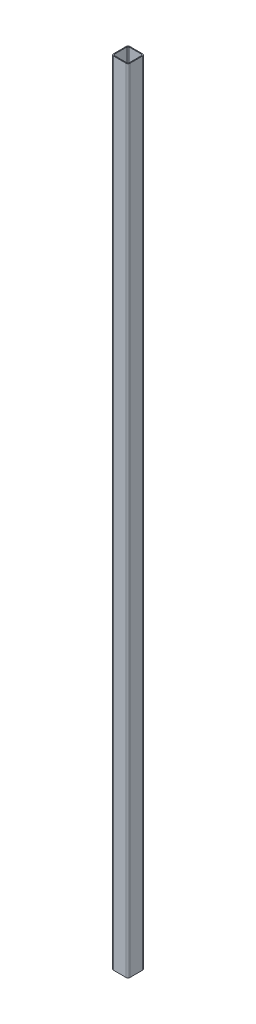
ISO-10303-21;
HEADER;
FILE_DESCRIPTION(('STEP AP214'),'2;1');
FILE_NAME('part.step','',(''),(''),'','','');
FILE_SCHEMA(('AUTOMOTIVE_DESIGN { 1 0 10303 214 1 1 1 1 }'));
ENDSEC;
DATA;
#1=APPLICATION_CONTEXT('core data for automotive mechanical design processes');
#2=APPLICATION_PROTOCOL_DEFINITION('international standard','automotive_design',2000,#1);
#3=PRODUCT_CONTEXT('',#1,'mechanical');
#4=PRODUCT('Part','Part','',(#3));
#5=PRODUCT_RELATED_PRODUCT_CATEGORY('part','',(#4));
#6=PRODUCT_DEFINITION_FORMATION('','',#4);
#7=PRODUCT_DEFINITION_CONTEXT('part definition',#1,'design');
#8=PRODUCT_DEFINITION('design','',#6,#7);
#9=PRODUCT_DEFINITION_SHAPE('','',#8);
#10=(LENGTH_UNIT() NAMED_UNIT(*) SI_UNIT(.MILLI.,.METRE.));
#11=(NAMED_UNIT(*) PLANE_ANGLE_UNIT() SI_UNIT($,.RADIAN.));
#12=(NAMED_UNIT(*) SI_UNIT($,.STERADIAN.) SOLID_ANGLE_UNIT());
#13=UNCERTAINTY_MEASURE_WITH_UNIT(LENGTH_MEASURE(1.E-05),#10,'distance_accuracy_value','');
#14=(GEOMETRIC_REPRESENTATION_CONTEXT(3) GLOBAL_UNCERTAINTY_ASSIGNED_CONTEXT((#13)) GLOBAL_UNIT_ASSIGNED_CONTEXT((#10,
#11,#12)) REPRESENTATION_CONTEXT('',''));
#15=CARTESIAN_POINT('',(0.,0.,0.));
#16=DIRECTION('',(0.,0.,1.));
#17=DIRECTION('',(1.,0.,0.));
#18=AXIS2_PLACEMENT_3D('',#15,#16,#17);
#19=CARTESIAN_POINT('',(-15.4999999999998,4.44089209850063E-13,-1064.5));
#20=DIRECTION('',(0.,1.,0.));
#21=DIRECTION('',(0.,0.,1.));
#22=AXIS2_PLACEMENT_3D('',#19,#20,#21);
#23=CYLINDRICAL_SURFACE('',#22,4.5);
#24=CARTESIAN_POINT('',(-15.4999999999998,1942.,-1064.5));
#25=DIRECTION('',(0.,1.,0.));
#26=DIRECTION('',(0.,0.,1.));
#27=AXIS2_PLACEMENT_3D('',#24,#25,#26);
#28=CIRCLE('',#27,4.5);
#29=CARTESIAN_POINT('',(-20.,1942.,-1064.5));
#30=VERTEX_POINT('',#29);
#31=CARTESIAN_POINT('',(-15.5000000000052,1942.,-1060.));
#32=VERTEX_POINT('',#31);
#33=EDGE_CURVE('E313',#30,#32,#28,.T.);
#34=ORIENTED_EDGE('',*,*,#33,.F.);
#35=DIRECTION('',(0.,1.,0.));
#36=VECTOR('',#35,1.);
#37=CARTESIAN_POINT('',(-20.,0.,-1064.5));
#38=LINE('',#37,#36);
#39=CARTESIAN_POINT('',(-20.,19.9999999999998,-1064.5));
#40=VERTEX_POINT('',#39);
#41=EDGE_CURVE('E206',#40,#30,#38,.T.);
#42=ORIENTED_EDGE('',*,*,#41,.F.);
#43=CARTESIAN_POINT('',(-15.4999999999998,20.0000000000005,-1064.5));
#44=DIRECTION('',(0.,-1.,0.));
#45=DIRECTION('',(0.,0.,-1.));
#46=AXIS2_PLACEMENT_3D('',#43,#44,#45);
#47=CIRCLE('',#46,4.5);
#48=CARTESIAN_POINT('',(-15.4999999999998,20.,-1060.));
#49=VERTEX_POINT('',#48);
#50=EDGE_CURVE('E361',#49,#40,#47,.T.);
#51=ORIENTED_EDGE('',*,*,#50,.F.);
#52=DIRECTION('',(0.,1.,0.));
#53=VECTOR('',#52,1.);
#54=CARTESIAN_POINT('',(-15.5000000000052,0.,-1060.));
#55=LINE('',#54,#53);
#56=EDGE_CURVE('E191',#49,#32,#55,.T.);
#57=ORIENTED_EDGE('',*,*,#56,.T.);
#58=EDGE_LOOP('',(#34,#42,#51,#57));
#59=FACE_BOUND('',#58,.T.);
#60=ADVANCED_FACE('F45',(#59),#23,.T.);
#61=CARTESIAN_POINT('',(-20.,0.,-1064.5));
#62=DIRECTION('',(1.,0.,0.));
#63=DIRECTION('',(0.,0.,-1.));
#64=AXIS2_PLACEMENT_3D('',#61,#62,#63);
#65=PLANE('',#64);
#66=DIRECTION('',(0.,0.,-1.));
#67=VECTOR('',#66,1.);
#68=CARTESIAN_POINT('',(-20.,1942.,2.66453525910038E-12));
#69=LINE('',#68,#67);
#70=CARTESIAN_POINT('',(-20.,1942.,-1095.5));
#71=VERTEX_POINT('',#70);
#72=EDGE_CURVE('E60',#30,#71,#69,.T.);
#73=ORIENTED_EDGE('',*,*,#72,.T.);
#74=DIRECTION('',(0.,1.,0.));
#75=VECTOR('',#74,1.);
#76=CARTESIAN_POINT('',(-20.0000000000025,4.44089209850063E-13,-1095.5));
#77=LINE('',#76,#75);
#78=CARTESIAN_POINT('',(-20.,20.0000000000005,-1095.5));
#79=VERTEX_POINT('',#78);
#80=EDGE_CURVE('E202',#79,#71,#77,.T.);
#81=ORIENTED_EDGE('',*,*,#80,.F.);
#82=DIRECTION('',(0.,0.,1.));
#83=VECTOR('',#82,1.);
#84=CARTESIAN_POINT('',(-19.999999999998,20.,-3240.));
#85=LINE('',#84,#83);
#86=EDGE_CURVE('E329',#79,#40,#85,.T.);
#87=ORIENTED_EDGE('',*,*,#86,.T.);
#88=ORIENTED_EDGE('',*,*,#41,.T.);
#89=EDGE_LOOP('',(#73,#81,#87,#88));
#90=FACE_BOUND('',#89,.T.);
#91=ADVANCED_FACE('F379',(#90),#65,.F.);
#92=CARTESIAN_POINT('',(-15.5000000000021,4.44089209850063E-13,-1095.5));
#93=DIRECTION('',(0.,1.,0.));
#94=DIRECTION('',(0.,0.,1.));
#95=AXIS2_PLACEMENT_3D('',#92,#93,#94);
#96=CYLINDRICAL_SURFACE('',#95,4.5);
#97=CARTESIAN_POINT('',(-15.4999999999998,1942.,-1095.5));
#98=DIRECTION('',(0.,1.,0.));
#99=DIRECTION('',(0.,0.,1.));
#100=AXIS2_PLACEMENT_3D('',#97,#98,#99);
#101=CIRCLE('',#100,4.5);
#102=CARTESIAN_POINT('',(-15.5000000000052,1942.,-1100.));
#103=VERTEX_POINT('',#102);
#104=EDGE_CURVE('E167',#103,#71,#101,.T.);
#105=ORIENTED_EDGE('',*,*,#104,.F.);
#106=DIRECTION('',(0.,1.,0.));
#107=VECTOR('',#106,1.);
#108=CARTESIAN_POINT('',(-15.5000000000074,0.,-1100.));
#109=LINE('',#108,#107);
#110=CARTESIAN_POINT('',(-15.5000000000056,20.,-1100.));
#111=VERTEX_POINT('',#110);
#112=EDGE_CURVE('E198',#111,#103,#109,.T.);
#113=ORIENTED_EDGE('',*,*,#112,.F.);
#114=CARTESIAN_POINT('',(-15.5000000000003,20.0000000000005,-1095.5));
#115=DIRECTION('',(0.,-1.,0.));
#116=DIRECTION('',(0.,0.,-1.));
#117=AXIS2_PLACEMENT_3D('',#114,#115,#116);
#118=CIRCLE('',#117,4.5);
#119=EDGE_CURVE('E234',#79,#111,#118,.T.);
#120=ORIENTED_EDGE('',*,*,#119,.F.);
#121=ORIENTED_EDGE('',*,*,#80,.T.);
#122=EDGE_LOOP('',(#105,#113,#120,#121));
#123=FACE_BOUND('',#122,.T.);
#124=ADVANCED_FACE('F376',(#123),#96,.T.);
#125=CARTESIAN_POINT('',(-15.5000000000074,0.,-1100.));
#126=DIRECTION('',(0.,0.,1.));
#127=DIRECTION('',(0.,-1.,0.));
#128=AXIS2_PLACEMENT_3D('',#125,#126,#127);
#129=PLANE('',#128);
#130=DIRECTION('',(-1.,0.,0.));
#131=VECTOR('',#130,1.);
#132=CARTESIAN_POINT('',(-15.5000000000052,1942.,-1100.));
#133=LINE('',#132,#131);
#134=CARTESIAN_POINT('',(15.4999999999945,1942.,-1100.));
#135=VERTEX_POINT('',#134);
#136=EDGE_CURVE('E320',#135,#103,#133,.T.);
#137=ORIENTED_EDGE('',*,*,#136,.F.);
#138=DIRECTION('',(0.,1.,0.));
#139=VECTOR('',#138,1.);
#140=CARTESIAN_POINT('',(15.4999999999927,0.,-1100.));
#141=LINE('',#140,#139);
#142=CARTESIAN_POINT('',(15.4999999999945,20.,-1100.));
#143=VERTEX_POINT('',#142);
#144=EDGE_CURVE('E189',#143,#135,#141,.T.);
#145=ORIENTED_EDGE('',*,*,#144,.F.);
#146=DIRECTION('',(1.,0.,0.));
#147=VECTOR('',#146,1.);
#148=CARTESIAN_POINT('',(-15.5000000000056,20.,-1100.));
#149=LINE('',#148,#147);
#150=EDGE_CURVE('E241',#111,#143,#149,.T.);
#151=ORIENTED_EDGE('',*,*,#150,.F.);
#152=ORIENTED_EDGE('',*,*,#112,.T.);
#153=EDGE_LOOP('',(#137,#145,#151,#152));
#154=FACE_BOUND('',#153,.T.);
#155=ADVANCED_FACE('F373',(#154),#129,.F.);
#156=CARTESIAN_POINT('',(15.4999999999981,4.44089209850063E-13,-1095.5));
#157=DIRECTION('',(0.,1.,0.));
#158=DIRECTION('',(0.,0.,1.));
#159=AXIS2_PLACEMENT_3D('',#156,#157,#158);
#160=CYLINDRICAL_SURFACE('',#159,4.5);
#161=CARTESIAN_POINT('',(15.4999999999998,1942.,-1095.5));
#162=DIRECTION('',(0.,1.,0.));
#163=DIRECTION('',(0.,0.,1.));
#164=AXIS2_PLACEMENT_3D('',#161,#162,#163);
#165=CIRCLE('',#164,4.5);
#166=CARTESIAN_POINT('',(20.,1942.,-1095.5));
#167=VERTEX_POINT('',#166);
#168=EDGE_CURVE('E323',#167,#135,#165,.T.);
#169=ORIENTED_EDGE('',*,*,#168,.F.);
#170=DIRECTION('',(0.,1.,0.));
#171=VECTOR('',#170,1.);
#172=CARTESIAN_POINT('',(19.9999999999976,1.11022302462516E-12,-1095.5));
#173=LINE('',#172,#171);
#174=CARTESIAN_POINT('',(20.,20.0000000000011,-1095.5));
#175=VERTEX_POINT('',#174);
#176=EDGE_CURVE('E176',#175,#167,#173,.T.);
#177=ORIENTED_EDGE('',*,*,#176,.F.);
#178=CARTESIAN_POINT('',(15.4999999999998,20.0000000000005,-1095.5));
#179=DIRECTION('',(0.,-1.,0.));
#180=DIRECTION('',(0.,0.,-1.));
#181=AXIS2_PLACEMENT_3D('',#178,#179,#180);
#182=CIRCLE('',#181,4.5);
#183=EDGE_CURVE('E248',#143,#175,#182,.T.);
#184=ORIENTED_EDGE('',*,*,#183,.F.);
#185=ORIENTED_EDGE('',*,*,#144,.T.);
#186=EDGE_LOOP('',(#169,#177,#184,#185));
#187=FACE_BOUND('',#186,.T.);
#188=ADVANCED_FACE('F369',(#187),#160,.T.);
#189=CARTESIAN_POINT('',(20.,4.44089209850063E-13,-1064.5));
#190=DIRECTION('',(-1.,0.,0.));
#191=DIRECTION('',(0.,0.,1.));
#192=AXIS2_PLACEMENT_3D('',#189,#190,#191);
#193=PLANE('',#192);
#194=DIRECTION('',(0.,0.,-1.));
#195=VECTOR('',#194,1.);
#196=CARTESIAN_POINT('',(20.,1942.,2.66453525910038E-12));
#197=LINE('',#196,#195);
#198=CARTESIAN_POINT('',(20.,1942.,-1064.49999999999));
#199=VERTEX_POINT('',#198);
#200=EDGE_CURVE('E158',#199,#167,#197,.T.);
#201=ORIENTED_EDGE('',*,*,#200,.F.);
#202=DIRECTION('',(0.,1.,0.));
#203=VECTOR('',#202,1.);
#204=CARTESIAN_POINT('',(20.,4.44089209850063E-13,-1064.5));
#205=LINE('',#204,#203);
#206=CARTESIAN_POINT('',(20.,20.0000000000005,-1064.5));
#207=VERTEX_POINT('',#206);
#208=EDGE_CURVE('E174',#207,#199,#205,.T.);
#209=ORIENTED_EDGE('',*,*,#208,.F.);
#210=DIRECTION('',(0.,0.,1.));
#211=VECTOR('',#210,1.);
#212=CARTESIAN_POINT('',(20.0000000000018,20.0000000000002,-3240.));
#213=LINE('',#212,#211);
#214=EDGE_CURVE('E326',#175,#207,#213,.T.);
#215=ORIENTED_EDGE('',*,*,#214,.F.);
#216=ORIENTED_EDGE('',*,*,#176,.T.);
#217=EDGE_LOOP('',(#201,#209,#215,#216));
#218=FACE_BOUND('',#217,.T.);
#219=ADVANCED_FACE('F172',(#218),#193,.F.);
#220=CARTESIAN_POINT('',(15.4999999999998,4.44089209850063E-13,-1064.5));
#221=DIRECTION('',(0.,1.,0.));
#222=DIRECTION('',(0.,0.,1.));
#223=AXIS2_PLACEMENT_3D('',#220,#221,#222);
#224=CYLINDRICAL_SURFACE('',#223,4.5);
#225=CARTESIAN_POINT('',(15.5000000000003,1942.,-1064.5));
#226=DIRECTION('',(0.,1.,0.));
#227=DIRECTION('',(0.,0.,1.));
#228=AXIS2_PLACEMENT_3D('',#225,#226,#227);
#229=CIRCLE('',#228,4.5);
#230=CARTESIAN_POINT('',(15.499999999995,1942.,-1060.));
#231=VERTEX_POINT('',#230);
#232=EDGE_CURVE('E155',#231,#199,#229,.T.);
#233=ORIENTED_EDGE('',*,*,#232,.F.);
#234=DIRECTION('',(0.,1.,0.));
#235=VECTOR('',#234,1.);
#236=CARTESIAN_POINT('',(15.4999999999945,0.,-1060.));
#237=LINE('',#236,#235);
#238=CARTESIAN_POINT('',(15.4999999999998,20.,-1060.));
#239=VERTEX_POINT('',#238);
#240=EDGE_CURVE('E183',#239,#231,#237,.T.);
#241=ORIENTED_EDGE('',*,*,#240,.F.);
#242=CARTESIAN_POINT('',(15.4999999999998,20.0000000000005,-1064.5));
#243=DIRECTION('',(0.,-1.,0.));
#244=DIRECTION('',(0.,0.,-1.));
#245=AXIS2_PLACEMENT_3D('',#242,#243,#244);
#246=CIRCLE('',#245,4.5);
#247=EDGE_CURVE('E181',#207,#239,#246,.T.);
#248=ORIENTED_EDGE('',*,*,#247,.F.);
#249=ORIENTED_EDGE('',*,*,#208,.T.);
#250=EDGE_LOOP('',(#233,#241,#248,#249));
#251=FACE_BOUND('',#250,.T.);
#252=ADVANCED_FACE('F180',(#251),#224,.T.);
#253=CARTESIAN_POINT('',(-15.5000000000052,0.,-1060.));
#254=DIRECTION('',(0.,0.,-1.));
#255=DIRECTION('',(0.,1.,0.));
#256=AXIS2_PLACEMENT_3D('',#253,#254,#255);
#257=PLANE('',#256);
#258=DIRECTION('',(1.,0.,0.));
#259=VECTOR('',#258,1.);
#260=CARTESIAN_POINT('',(-15.5000000000052,1942.,-1060.));
#261=LINE('',#260,#259);
#262=EDGE_CURVE('E161',#32,#231,#261,.T.);
#263=ORIENTED_EDGE('',*,*,#262,.F.);
#264=ORIENTED_EDGE('',*,*,#56,.F.);
#265=DIRECTION('',(-1.,0.,0.));
#266=VECTOR('',#265,1.);
#267=CARTESIAN_POINT('',(-15.4999999999998,20.,-1060.));
#268=LINE('',#267,#266);
#269=EDGE_CURVE('E356',#239,#49,#268,.T.);
#270=ORIENTED_EDGE('',*,*,#269,.F.);
#271=ORIENTED_EDGE('',*,*,#240,.T.);
#272=EDGE_LOOP('',(#263,#264,#270,#271));
#273=FACE_BOUND('',#272,.T.);
#274=ADVANCED_FACE('F386',(#273),#257,.F.);
#275=CARTESIAN_POINT('',(-15.4999999999981,20.0000000000005,-3240.));
#276=DIRECTION('',(0.,-1.,0.));
#277=DIRECTION('',(0.,0.,-1.));
#278=AXIS2_PLACEMENT_3D('',#275,#276,#277);
#279=PLANE('',#278);
#280=DIRECTION('',(-1.,0.,0.));
#281=VECTOR('',#280,1.);
#282=CARTESIAN_POINT('',(-15.0000000000001,20.0000000000005,-1062.));
#283=LINE('',#282,#281);
#284=CARTESIAN_POINT('',(15.0000000000001,20.0000000000005,-1062.));
#285=VERTEX_POINT('',#284);
#286=CARTESIAN_POINT('',(-15.0000000000001,20.0000000000005,-1062.));
#287=VERTEX_POINT('',#286);
#288=EDGE_CURVE('E349',#285,#287,#283,.T.);
#289=ORIENTED_EDGE('',*,*,#288,.F.);
#290=CARTESIAN_POINT('',(15.0000000000001,20.,-1065.));
#291=DIRECTION('',(0.,-1.,0.));
#292=DIRECTION('',(0.,0.,-1.));
#293=AXIS2_PLACEMENT_3D('',#290,#291,#292);
#294=CIRCLE('',#293,3.);
#295=CARTESIAN_POINT('',(18.0000000000002,20.,-1065.));
#296=VERTEX_POINT('',#295);
#297=EDGE_CURVE('E285',#296,#285,#294,.T.);
#298=ORIENTED_EDGE('',*,*,#297,.F.);
#299=DIRECTION('',(0.,0.,1.));
#300=VECTOR('',#299,1.);
#301=CARTESIAN_POINT('',(18.0000000000002,20.,-1065.));
#302=LINE('',#301,#300);
#303=CARTESIAN_POINT('',(17.9999999999998,20.,-1095.));
#304=VERTEX_POINT('',#303);
#305=EDGE_CURVE('E280',#304,#296,#302,.T.);
#306=ORIENTED_EDGE('',*,*,#305,.F.);
#307=CARTESIAN_POINT('',(14.9999999999997,20.,-1095.));
#308=DIRECTION('',(0.,-1.,0.));
#309=DIRECTION('',(0.,0.,-1.));
#310=AXIS2_PLACEMENT_3D('',#307,#308,#309);
#311=CIRCLE('',#310,3.);
#312=CARTESIAN_POINT('',(14.9999999999944,20.,-1098.));
#313=VERTEX_POINT('',#312);
#314=EDGE_CURVE('E341',#313,#304,#311,.T.);
#315=ORIENTED_EDGE('',*,*,#314,.F.);
#316=DIRECTION('',(1.,0.,0.));
#317=VECTOR('',#316,1.);
#318=CARTESIAN_POINT('',(-15.0000000000055,20.0000000000005,-1098.));
#319=LINE('',#318,#317);
#320=CARTESIAN_POINT('',(-15.0000000000055,20.0000000000005,-1097.99999999999));
#321=VERTEX_POINT('',#320);
#322=EDGE_CURVE('E337',#321,#313,#319,.T.);
#323=ORIENTED_EDGE('',*,*,#322,.F.);
#324=CARTESIAN_POINT('',(-15.0000000000001,20.,-1095.));
#325=DIRECTION('',(0.,-1.,0.));
#326=DIRECTION('',(0.,0.,-1.));
#327=AXIS2_PLACEMENT_3D('',#324,#325,#326);
#328=CIRCLE('',#327,3.);
#329=CARTESIAN_POINT('',(-18.0000000000002,20.,-1095.));
#330=VERTEX_POINT('',#329);
#331=EDGE_CURVE('E333',#330,#321,#328,.T.);
#332=ORIENTED_EDGE('',*,*,#331,.F.);
#333=DIRECTION('',(0.,0.,-1.));
#334=VECTOR('',#333,1.);
#335=CARTESIAN_POINT('',(-17.9999999999998,20.,-1065.));
#336=LINE('',#335,#334);
#337=CARTESIAN_POINT('',(-17.9999999999998,20.,-1065.));
#338=VERTEX_POINT('',#337);
#339=EDGE_CURVE('E53',#338,#330,#336,.T.);
#340=ORIENTED_EDGE('',*,*,#339,.F.);
#341=CARTESIAN_POINT('',(-15.0000000000001,20.,-1065.));
#342=DIRECTION('',(0.,-1.,0.));
#343=DIRECTION('',(0.,0.,-1.));
#344=AXIS2_PLACEMENT_3D('',#341,#342,#343);
#345=CIRCLE('',#344,3.);
#346=EDGE_CURVE('E352',#287,#338,#345,.T.);
#347=ORIENTED_EDGE('',*,*,#346,.F.);
#348=EDGE_LOOP('',(#289,#298,#306,#315,#323,#332,#340,#347));
#349=FACE_BOUND('',#348,.T.);
#350=ORIENTED_EDGE('',*,*,#119,.T.);
#351=ORIENTED_EDGE('',*,*,#150,.T.);
#352=ORIENTED_EDGE('',*,*,#183,.T.);
#353=ORIENTED_EDGE('',*,*,#214,.T.);
#354=ORIENTED_EDGE('',*,*,#247,.T.);
#355=ORIENTED_EDGE('',*,*,#269,.T.);
#356=ORIENTED_EDGE('',*,*,#50,.T.);
#357=ORIENTED_EDGE('',*,*,#86,.F.);
#358=EDGE_LOOP('',(#350,#351,#352,#353,#354,#355,#356,#357));
#359=FACE_BOUND('',#358,.T.);
#360=ADVANCED_FACE('F366',(#349,#359),#279,.T.);
#361=CARTESIAN_POINT('',(-15.0000000000001,0.,-1065.));
#362=DIRECTION('',(0.,1.,0.));
#363=DIRECTION('',(0.,0.,1.));
#364=AXIS2_PLACEMENT_3D('',#361,#362,#363);
#365=CYLINDRICAL_SURFACE('',#364,3.);
#366=DIRECTION('',(0.,1.,0.));
#367=VECTOR('',#366,1.);
#368=CARTESIAN_POINT('',(-18.0000000000002,0.,-1065.));
#369=LINE('',#368,#367);
#370=CARTESIAN_POINT('',(-17.9999999999998,1942.,-1065.));
#371=VERTEX_POINT('',#370);
#372=EDGE_CURVE('E209',#338,#371,#369,.T.);
#373=ORIENTED_EDGE('',*,*,#372,.T.);
#374=CARTESIAN_POINT('',(-14.9999999999997,1942.,-1065.));
#375=DIRECTION('',(0.,1.,0.));
#376=DIRECTION('',(0.,0.,1.));
#377=AXIS2_PLACEMENT_3D('',#374,#375,#376);
#378=CIRCLE('',#377,3.);
#379=CARTESIAN_POINT('',(-15.000000000005,1942.,-1062.));
#380=VERTEX_POINT('',#379);
#381=EDGE_CURVE('E11',#371,#380,#378,.T.);
#382=ORIENTED_EDGE('',*,*,#381,.T.);
#383=DIRECTION('',(0.,1.,0.));
#384=VECTOR('',#383,1.);
#385=CARTESIAN_POINT('',(-15.0000000000055,4.44089209850063E-13,-1062.));
#386=LINE('',#385,#384);
#387=EDGE_CURVE('E212',#287,#380,#386,.T.);
#388=ORIENTED_EDGE('',*,*,#387,.F.);
#389=ORIENTED_EDGE('',*,*,#346,.T.);
#390=EDGE_LOOP('',(#373,#382,#388,#389));
#391=FACE_BOUND('',#390,.T.);
#392=ADVANCED_FACE('F393',(#391),#365,.F.);
#393=CARTESIAN_POINT('',(-15.0000000000055,4.44089209850063E-13,-1062.));
#394=DIRECTION('',(0.,0.,-1.));
#395=DIRECTION('',(0.,1.,0.));
#396=AXIS2_PLACEMENT_3D('',#393,#394,#395);
#397=PLANE('',#396);
#398=ORIENTED_EDGE('',*,*,#387,.T.);
#399=DIRECTION('',(1.,0.,0.));
#400=VECTOR('',#399,1.);
#401=CARTESIAN_POINT('',(-15.000000000005,1942.,-1062.));
#402=LINE('',#401,#400);
#403=CARTESIAN_POINT('',(14.9999999999948,1942.,-1062.));
#404=VERTEX_POINT('',#403);
#405=EDGE_CURVE('E68',#380,#404,#402,.T.);
#406=ORIENTED_EDGE('',*,*,#405,.T.);
#407=DIRECTION('',(0.,1.,0.));
#408=VECTOR('',#407,1.);
#409=CARTESIAN_POINT('',(14.9999999999948,4.44089209850063E-13,-1062.));
#410=LINE('',#409,#408);
#411=EDGE_CURVE('E220',#285,#404,#410,.T.);
#412=ORIENTED_EDGE('',*,*,#411,.F.);
#413=ORIENTED_EDGE('',*,*,#288,.T.);
#414=EDGE_LOOP('',(#398,#406,#412,#413));
#415=FACE_BOUND('',#414,.T.);
#416=ADVANCED_FACE('F452',(#415),#397,.T.);
#417=CARTESIAN_POINT('',(15.0000000000001,0.,-1065.));
#418=DIRECTION('',(0.,1.,0.));
#419=DIRECTION('',(0.,0.,1.));
#420=AXIS2_PLACEMENT_3D('',#417,#418,#419);
#421=CYLINDRICAL_SURFACE('',#420,3.);
#422=ORIENTED_EDGE('',*,*,#411,.T.);
#423=CARTESIAN_POINT('',(15.0000000000001,1942.,-1065.));
#424=DIRECTION('',(0.,1.,0.));
#425=DIRECTION('',(0.,0.,1.));
#426=AXIS2_PLACEMENT_3D('',#423,#424,#425);
#427=CIRCLE('',#426,3.);
#428=CARTESIAN_POINT('',(18.0000000000002,1942.,-1065.));
#429=VERTEX_POINT('',#428);
#430=EDGE_CURVE('E287',#404,#429,#427,.T.);
#431=ORIENTED_EDGE('',*,*,#430,.T.);
#432=DIRECTION('',(0.,1.,0.));
#433=VECTOR('',#432,1.);
#434=CARTESIAN_POINT('',(17.9999999999998,0.,-1065.));
#435=LINE('',#434,#433);
#436=EDGE_CURVE('E229',#296,#429,#435,.T.);
#437=ORIENTED_EDGE('',*,*,#436,.F.);
#438=ORIENTED_EDGE('',*,*,#297,.T.);
#439=EDGE_LOOP('',(#422,#431,#437,#438));
#440=FACE_BOUND('',#439,.T.);
#441=ADVANCED_FACE('F284',(#440),#421,.F.);
#442=CARTESIAN_POINT('',(17.9999999999998,0.,-1065.));
#443=DIRECTION('',(-1.,0.,0.));
#444=DIRECTION('',(0.,0.,1.));
#445=AXIS2_PLACEMENT_3D('',#442,#443,#444);
#446=PLANE('',#445);
#447=ORIENTED_EDGE('',*,*,#436,.T.);
#448=DIRECTION('',(0.,0.,-1.));
#449=VECTOR('',#448,1.);
#450=CARTESIAN_POINT('',(18.0000000000002,1942.,-1065.));
#451=LINE('',#450,#449);
#452=CARTESIAN_POINT('',(17.9999999999998,1942.,-1095.));
#453=VERTEX_POINT('',#452);
#454=EDGE_CURVE('E279',#429,#453,#451,.T.);
#455=ORIENTED_EDGE('',*,*,#454,.T.);
#456=DIRECTION('',(0.,1.,0.));
#457=VECTOR('',#456,1.);
#458=CARTESIAN_POINT('',(17.9999999999927,0.,-1095.));
#459=LINE('',#458,#457);
#460=EDGE_CURVE('E266',#304,#453,#459,.T.);
#461=ORIENTED_EDGE('',*,*,#460,.F.);
#462=ORIENTED_EDGE('',*,*,#305,.T.);
#463=EDGE_LOOP('',(#447,#455,#461,#462));
#464=FACE_BOUND('',#463,.T.);
#465=ADVANCED_FACE('F277',(#464),#446,.T.);
#466=CARTESIAN_POINT('',(14.9999999999926,0.,-1095.));
#467=DIRECTION('',(0.,1.,0.));
#468=DIRECTION('',(0.,0.,1.));
#469=AXIS2_PLACEMENT_3D('',#466,#467,#468);
#470=CYLINDRICAL_SURFACE('',#469,3.);
#471=ORIENTED_EDGE('',*,*,#460,.T.);
#472=CARTESIAN_POINT('',(15.0000000000001,1942.,-1095.));
#473=DIRECTION('',(0.,1.,0.));
#474=DIRECTION('',(0.,0.,1.));
#475=AXIS2_PLACEMENT_3D('',#472,#473,#474);
#476=CIRCLE('',#475,3.);
#477=CARTESIAN_POINT('',(14.9999999999948,1942.,-1098.));
#478=VERTEX_POINT('',#477);
#479=EDGE_CURVE('E293',#453,#478,#476,.T.);
#480=ORIENTED_EDGE('',*,*,#479,.T.);
#481=DIRECTION('',(0.,1.,0.));
#482=VECTOR('',#481,1.);
#483=CARTESIAN_POINT('',(14.9999999999926,0.,-1098.));
#484=LINE('',#483,#482);
#485=EDGE_CURVE('E262',#313,#478,#484,.T.);
#486=ORIENTED_EDGE('',*,*,#485,.F.);
#487=ORIENTED_EDGE('',*,*,#314,.T.);
#488=EDGE_LOOP('',(#471,#480,#486,#487));
#489=FACE_BOUND('',#488,.T.);
#490=ADVANCED_FACE('F444',(#489),#470,.F.);
#491=CARTESIAN_POINT('',(-15.0000000000072,4.44089209850063E-13,-1098.));
#492=DIRECTION('',(0.,0.,1.));
#493=DIRECTION('',(0.,-1.,0.));
#494=AXIS2_PLACEMENT_3D('',#491,#492,#493);
#495=PLANE('',#494);
#496=ORIENTED_EDGE('',*,*,#485,.T.);
#497=DIRECTION('',(-1.,0.,0.));
#498=VECTOR('',#497,1.);
#499=CARTESIAN_POINT('',(-15.0000000000055,1942.,-1098.));
#500=LINE('',#499,#498);
#501=CARTESIAN_POINT('',(-15.0000000000055,1942.,-1098.));
#502=VERTEX_POINT('',#501);
#503=EDGE_CURVE('E301',#478,#502,#500,.T.);
#504=ORIENTED_EDGE('',*,*,#503,.T.);
#505=DIRECTION('',(0.,1.,0.));
#506=VECTOR('',#505,1.);
#507=CARTESIAN_POINT('',(-15.0000000000072,4.44089209850063E-13,-1098.));
#508=LINE('',#507,#506);
#509=EDGE_CURVE('E258',#321,#502,#508,.T.);
#510=ORIENTED_EDGE('',*,*,#509,.F.);
#511=ORIENTED_EDGE('',*,*,#322,.T.);
#512=EDGE_LOOP('',(#496,#504,#510,#511));
#513=FACE_BOUND('',#512,.T.);
#514=ADVANCED_FACE('F441',(#513),#495,.T.);
#515=CARTESIAN_POINT('',(-15.0000000000072,0.,-1095.));
#516=DIRECTION('',(0.,1.,0.));
#517=DIRECTION('',(0.,0.,1.));
#518=AXIS2_PLACEMENT_3D('',#515,#516,#517);
#519=CYLINDRICAL_SURFACE('',#518,3.);
#520=ORIENTED_EDGE('',*,*,#509,.T.);
#521=CARTESIAN_POINT('',(-15.0000000000001,1942.,-1095.));
#522=DIRECTION('',(0.,1.,0.));
#523=DIRECTION('',(0.,0.,1.));
#524=AXIS2_PLACEMENT_3D('',#521,#522,#523);
#525=CIRCLE('',#524,3.);
#526=CARTESIAN_POINT('',(-18.0000000000002,1942.,-1095.));
#527=VERTEX_POINT('',#526);
#528=EDGE_CURVE('E305',#502,#527,#525,.T.);
#529=ORIENTED_EDGE('',*,*,#528,.T.);
#530=DIRECTION('',(0.,1.,0.));
#531=VECTOR('',#530,1.);
#532=CARTESIAN_POINT('',(-18.0000000000073,0.,-1095.));
#533=LINE('',#532,#531);
#534=EDGE_CURVE('E255',#330,#527,#533,.T.);
#535=ORIENTED_EDGE('',*,*,#534,.F.);
#536=ORIENTED_EDGE('',*,*,#331,.T.);
#537=EDGE_LOOP('',(#520,#529,#535,#536));
#538=FACE_BOUND('',#537,.T.);
#539=ADVANCED_FACE('F422',(#538),#519,.F.);
#540=CARTESIAN_POINT('',(-18.0000000000002,0.,-1065.));
#541=DIRECTION('',(1.,0.,0.));
#542=DIRECTION('',(0.,0.,-1.));
#543=AXIS2_PLACEMENT_3D('',#540,#541,#542);
#544=PLANE('',#543);
#545=ORIENTED_EDGE('',*,*,#534,.T.);
#546=DIRECTION('',(0.,0.,1.));
#547=VECTOR('',#546,1.);
#548=CARTESIAN_POINT('',(-17.9999999999998,1942.,-1065.));
#549=LINE('',#548,#547);
#550=EDGE_CURVE('E309',#527,#371,#549,.T.);
#551=ORIENTED_EDGE('',*,*,#550,.T.);
#552=ORIENTED_EDGE('',*,*,#372,.F.);
#553=ORIENTED_EDGE('',*,*,#339,.T.);
#554=EDGE_LOOP('',(#545,#551,#552,#553));
#555=FACE_BOUND('',#554,.T.);
#556=ADVANCED_FACE('F420',(#555),#544,.T.);
#557=CARTESIAN_POINT('',(-15.4999999999998,1942.,2.66453525910038E-12));
#558=DIRECTION('',(0.,1.,0.));
#559=DIRECTION('',(0.,0.,1.));
#560=AXIS2_PLACEMENT_3D('',#557,#558,#559);
#561=PLANE('',#560);
#562=ORIENTED_EDGE('',*,*,#528,.F.);
#563=ORIENTED_EDGE('',*,*,#503,.F.);
#564=ORIENTED_EDGE('',*,*,#479,.F.);
#565=ORIENTED_EDGE('',*,*,#454,.F.);
#566=ORIENTED_EDGE('',*,*,#430,.F.);
#567=ORIENTED_EDGE('',*,*,#405,.F.);
#568=ORIENTED_EDGE('',*,*,#381,.F.);
#569=ORIENTED_EDGE('',*,*,#550,.F.);
#570=EDGE_LOOP('',(#562,#563,#564,#565,#566,#567,#568,#569));
#571=FACE_BOUND('',#570,.T.);
#572=ORIENTED_EDGE('',*,*,#168,.T.);
#573=ORIENTED_EDGE('',*,*,#136,.T.);
#574=ORIENTED_EDGE('',*,*,#104,.T.);
#575=ORIENTED_EDGE('',*,*,#72,.F.);
#576=ORIENTED_EDGE('',*,*,#33,.T.);
#577=ORIENTED_EDGE('',*,*,#262,.T.);
#578=ORIENTED_EDGE('',*,*,#232,.T.);
#579=ORIENTED_EDGE('',*,*,#200,.T.);
#580=EDGE_LOOP('',(#572,#573,#574,#575,#576,#577,#578,#579));
#581=FACE_BOUND('',#580,.T.);
#582=ADVANCED_FACE('F157',(#571,#581),#561,.T.);
#583=CLOSED_SHELL('',(#60,#91,#124,#155,#188,#219,#252,#274,#360,#392,#416,#441,#465,#490,#514,
#539,#556,#582));
#584=MANIFOLD_SOLID_BREP('B2',#583);
#585=ADVANCED_BREP_SHAPE_REPRESENTATION('',(#18,#584),#14);
#586=SHAPE_DEFINITION_REPRESENTATION(#9,#585);
ENDSEC;
END-ISO-10303-21;
